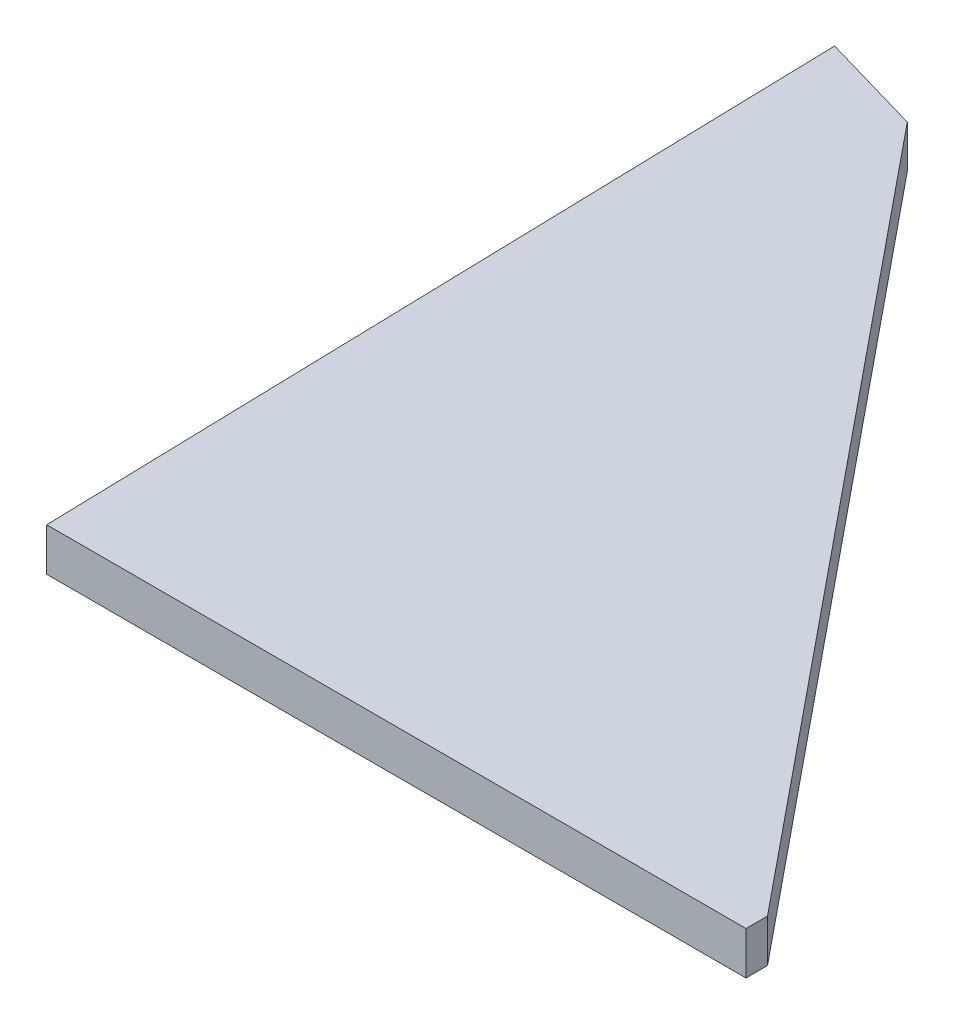
ISO-10303-21;
HEADER;
FILE_DESCRIPTION(('STEP AP214'),'2;1');
FILE_NAME('part.step','',(''),(''),'','','');
FILE_SCHEMA(('AUTOMOTIVE_DESIGN { 1 0 10303 214 1 1 1 1 }'));
ENDSEC;
DATA;
#1=APPLICATION_CONTEXT('core data for automotive mechanical design processes');
#2=APPLICATION_PROTOCOL_DEFINITION('international standard','automotive_design',2000,#1);
#3=PRODUCT_CONTEXT('',#1,'mechanical');
#4=PRODUCT('Part','Part','',(#3));
#5=PRODUCT_RELATED_PRODUCT_CATEGORY('part','',(#4));
#6=PRODUCT_DEFINITION_FORMATION('','',#4);
#7=PRODUCT_DEFINITION_CONTEXT('part definition',#1,'design');
#8=PRODUCT_DEFINITION('design','',#6,#7);
#9=PRODUCT_DEFINITION_SHAPE('','',#8);
#10=(LENGTH_UNIT() NAMED_UNIT(*) SI_UNIT(.MILLI.,.METRE.));
#11=(NAMED_UNIT(*) PLANE_ANGLE_UNIT() SI_UNIT($,.RADIAN.));
#12=(NAMED_UNIT(*) SI_UNIT($,.STERADIAN.) SOLID_ANGLE_UNIT());
#13=UNCERTAINTY_MEASURE_WITH_UNIT(LENGTH_MEASURE(1.E-05),#10,'distance_accuracy_value','');
#14=(GEOMETRIC_REPRESENTATION_CONTEXT(3) GLOBAL_UNCERTAINTY_ASSIGNED_CONTEXT((#13)) GLOBAL_UNIT_ASSIGNED_CONTEXT((#10,
#11,#12)) REPRESENTATION_CONTEXT('',''));
#15=CARTESIAN_POINT('',(0.,0.,0.));
#16=DIRECTION('',(0.,0.,1.));
#17=DIRECTION('',(1.,0.,0.));
#18=AXIS2_PLACEMENT_3D('',#15,#16,#17);
#19=CARTESIAN_POINT('',(32.6229076316677,2.,0.));
#20=DIRECTION('',(-1.,0.,0.));
#21=DIRECTION('',(0.,0.,1.));
#22=AXIS2_PLACEMENT_3D('',#19,#20,#21);
#23=PLANE('',#22);
#24=DIRECTION('',(0.,0.,-1.));
#25=VECTOR('',#24,1.);
#26=CARTESIAN_POINT('',(32.6229076316677,0.,0.));
#27=LINE('',#26,#25);
#28=CARTESIAN_POINT('',(32.6229076316677,0.,0.));
#29=VERTEX_POINT('',#28);
#30=CARTESIAN_POINT('',(32.6229076316677,0.,-1.00441654775911));
#31=VERTEX_POINT('',#30);
#32=EDGE_CURVE('E118',#29,#31,#27,.T.);
#33=ORIENTED_EDGE('',*,*,#32,.T.);
#34=DIRECTION('',(0.,-1.,0.));
#35=VECTOR('',#34,1.);
#36=CARTESIAN_POINT('',(32.6229076316677,2.,-1.00441654775911));
#37=LINE('',#36,#35);
#38=CARTESIAN_POINT('',(32.6229076316677,2.,-1.00441654775911));
#39=VERTEX_POINT('',#38);
#40=EDGE_CURVE('E11',#39,#31,#37,.T.);
#41=ORIENTED_EDGE('',*,*,#40,.F.);
#42=DIRECTION('',(0.,0.,-1.));
#43=VECTOR('',#42,1.);
#44=CARTESIAN_POINT('',(32.6229076316677,2.,0.));
#45=LINE('',#44,#43);
#46=CARTESIAN_POINT('',(32.6229076316677,2.,0.));
#47=VERTEX_POINT('',#46);
#48=EDGE_CURVE('E131',#47,#39,#45,.T.);
#49=ORIENTED_EDGE('',*,*,#48,.F.);
#50=DIRECTION('',(0.,-1.,0.));
#51=VECTOR('',#50,1.);
#52=CARTESIAN_POINT('',(32.6229076316677,2.,0.));
#53=LINE('',#52,#51);
#54=EDGE_CURVE('E114',#47,#29,#53,.T.);
#55=ORIENTED_EDGE('',*,*,#54,.T.);
#56=EDGE_LOOP('',(#33,#41,#49,#55));
#57=FACE_BOUND('',#56,.T.);
#58=ADVANCED_FACE('F39',(#57),#23,.F.);
#59=CARTESIAN_POINT('',(32.6229076316677,2.,-1.00441654775911));
#60=DIRECTION('',(-0.774992731591023,0.,0.631970146431843));
#61=DIRECTION('',(0.631970146431843,0.,0.774992731591023));
#62=AXIS2_PLACEMENT_3D('',#59,#60,#61);
#63=PLANE('',#62);
#64=DIRECTION('',(-0.631970146431843,0.,-0.774992731591023));
#65=VECTOR('',#64,1.);
#66=CARTESIAN_POINT('',(32.6229076316677,0.,-1.00441654775911));
#67=LINE('',#66,#65);
#68=CARTESIAN_POINT('',(3.8052981504117,0.,-36.3438040424033));
#69=VERTEX_POINT('',#68);
#70=EDGE_CURVE('E122',#31,#69,#67,.T.);
#71=ORIENTED_EDGE('',*,*,#70,.T.);
#72=DIRECTION('',(0.,-1.,0.));
#73=VECTOR('',#72,1.);
#74=CARTESIAN_POINT('',(3.8052981504117,2.,-36.3438040424033));
#75=LINE('',#74,#73);
#76=CARTESIAN_POINT('',(3.8052981504117,2.,-36.3438040424033));
#77=VERTEX_POINT('',#76);
#78=EDGE_CURVE('E48',#77,#69,#75,.T.);
#79=ORIENTED_EDGE('',*,*,#78,.F.);
#80=DIRECTION('',(-0.631970146431843,0.,-0.774992731591023));
#81=VECTOR('',#80,1.);
#82=CARTESIAN_POINT('',(32.6229076316677,2.,-1.00441654775911));
#83=LINE('',#82,#81);
#84=EDGE_CURVE('E90',#39,#77,#83,.T.);
#85=ORIENTED_EDGE('',*,*,#84,.F.);
#86=ORIENTED_EDGE('',*,*,#40,.T.);
#87=EDGE_LOOP('',(#71,#79,#85,#86));
#88=FACE_BOUND('',#87,.T.);
#89=ADVANCED_FACE('F153',(#88),#63,.F.);
#90=CARTESIAN_POINT('',(3.8052981504117,2.,-36.3438040424033));
#91=DIRECTION('',(-0.277979583154811,0.,0.96058698270853));
#92=DIRECTION('',(0.96058698270853,0.,0.277979583154811));
#93=AXIS2_PLACEMENT_3D('',#90,#91,#92);
#94=PLANE('',#93);
#95=DIRECTION('',(-0.96058698270853,0.,-0.277979583154811));
#96=VECTOR('',#95,1.);
#97=CARTESIAN_POINT('',(3.8052981504117,0.,-36.3438040424033));
#98=LINE('',#97,#96);
#99=CARTESIAN_POINT('',(-0.96563018671883,0.,-37.7244397310918));
#100=VERTEX_POINT('',#99);
#101=EDGE_CURVE('E106',#69,#100,#98,.T.);
#102=ORIENTED_EDGE('',*,*,#101,.T.);
#103=DIRECTION('',(0.,-1.,0.));
#104=VECTOR('',#103,1.);
#105=CARTESIAN_POINT('',(-0.96563018671883,2.,-37.7244397310918));
#106=LINE('',#105,#104);
#107=CARTESIAN_POINT('',(-0.96563018671883,2.,-37.7244397310918));
#108=VERTEX_POINT('',#107);
#109=EDGE_CURVE('E103',#108,#100,#106,.T.);
#110=ORIENTED_EDGE('',*,*,#109,.F.);
#111=DIRECTION('',(-0.96058698270853,0.,-0.277979583154811));
#112=VECTOR('',#111,1.);
#113=CARTESIAN_POINT('',(3.8052981504117,2.,-36.3438040424033));
#114=LINE('',#113,#112);
#115=EDGE_CURVE('E94',#77,#108,#114,.T.);
#116=ORIENTED_EDGE('',*,*,#115,.F.);
#117=ORIENTED_EDGE('',*,*,#78,.T.);
#118=EDGE_LOOP('',(#102,#110,#116,#117));
#119=FACE_BOUND('',#118,.T.);
#120=ADVANCED_FACE('F104',(#119),#94,.F.);
#121=CARTESIAN_POINT('',(-0.96563018671883,2.,-37.7244397310918));
#122=DIRECTION('',(0.999672559250535,0.,-0.0255885576280988));
#123=DIRECTION('',(-0.0255885576280988,0.,-0.999672559250535));
#124=AXIS2_PLACEMENT_3D('',#121,#122,#123);
#125=PLANE('',#124);
#126=DIRECTION('',(0.0255885576280988,0.,0.999672559250535));
#127=VECTOR('',#126,1.);
#128=CARTESIAN_POINT('',(-0.96563018671883,0.,-37.7244397310918));
#129=LINE('',#128,#127);
#130=CARTESIAN_POINT('',(0.,0.,0.));
#131=VERTEX_POINT('',#130);
#132=EDGE_CURVE('E76',#100,#131,#129,.T.);
#133=ORIENTED_EDGE('',*,*,#132,.T.);
#134=DIRECTION('',(0.,-1.,0.));
#135=VECTOR('',#134,1.);
#136=CARTESIAN_POINT('',(0.,2.,0.));
#137=LINE('',#136,#135);
#138=CARTESIAN_POINT('',(0.,2.,0.));
#139=VERTEX_POINT('',#138);
#140=EDGE_CURVE('E108',#139,#131,#137,.T.);
#141=ORIENTED_EDGE('',*,*,#140,.F.);
#142=DIRECTION('',(0.0255885576280988,0.,0.999672559250535));
#143=VECTOR('',#142,1.);
#144=CARTESIAN_POINT('',(-0.96563018671883,2.,-37.7244397310918));
#145=LINE('',#144,#143);
#146=EDGE_CURVE('E98',#108,#139,#145,.T.);
#147=ORIENTED_EDGE('',*,*,#146,.F.);
#148=ORIENTED_EDGE('',*,*,#109,.T.);
#149=EDGE_LOOP('',(#133,#141,#147,#148));
#150=FACE_BOUND('',#149,.T.);
#151=ADVANCED_FACE('F110',(#150),#125,.F.);
#152=CARTESIAN_POINT('',(0.,2.,0.));
#153=DIRECTION('',(0.,0.,-1.));
#154=DIRECTION('',(-1.,0.,0.));
#155=AXIS2_PLACEMENT_3D('',#152,#153,#154);
#156=PLANE('',#155);
#157=DIRECTION('',(1.,0.,0.));
#158=VECTOR('',#157,1.);
#159=CARTESIAN_POINT('',(0.,0.,0.));
#160=LINE('',#159,#158);
#161=EDGE_CURVE('E82',#131,#29,#160,.T.);
#162=ORIENTED_EDGE('',*,*,#161,.T.);
#163=ORIENTED_EDGE('',*,*,#54,.F.);
#164=DIRECTION('',(1.,0.,0.));
#165=VECTOR('',#164,1.);
#166=CARTESIAN_POINT('',(0.,2.,0.));
#167=LINE('',#166,#165);
#168=EDGE_CURVE('E56',#139,#47,#167,.T.);
#169=ORIENTED_EDGE('',*,*,#168,.F.);
#170=ORIENTED_EDGE('',*,*,#140,.T.);
#171=EDGE_LOOP('',(#162,#163,#169,#170));
#172=FACE_BOUND('',#171,.T.);
#173=ADVANCED_FACE('F142',(#172),#156,.F.);
#174=CARTESIAN_POINT('',(0.,2.,0.));
#175=DIRECTION('',(0.,-1.,0.));
#176=DIRECTION('',(0.,0.,-1.));
#177=AXIS2_PLACEMENT_3D('',#174,#175,#176);
#178=PLANE('',#177);
#179=ORIENTED_EDGE('',*,*,#48,.T.);
#180=ORIENTED_EDGE('',*,*,#84,.T.);
#181=ORIENTED_EDGE('',*,*,#115,.T.);
#182=ORIENTED_EDGE('',*,*,#146,.T.);
#183=ORIENTED_EDGE('',*,*,#168,.T.);
#184=EDGE_LOOP('',(#179,#180,#181,#182,#183));
#185=FACE_BOUND('',#184,.T.);
#186=ADVANCED_FACE('F96',(#185),#178,.F.);
#187=CARTESIAN_POINT('',(0.,0.,0.));
#188=DIRECTION('',(0.,-1.,0.));
#189=DIRECTION('',(0.,0.,-1.));
#190=AXIS2_PLACEMENT_3D('',#187,#188,#189);
#191=PLANE('',#190);
#192=ORIENTED_EDGE('',*,*,#32,.F.);
#193=ORIENTED_EDGE('',*,*,#161,.F.);
#194=ORIENTED_EDGE('',*,*,#132,.F.);
#195=ORIENTED_EDGE('',*,*,#101,.F.);
#196=ORIENTED_EDGE('',*,*,#70,.F.);
#197=EDGE_LOOP('',(#192,#193,#194,#195,#196));
#198=FACE_BOUND('',#197,.T.);
#199=ADVANCED_FACE('F138',(#198),#191,.T.);
#200=CLOSED_SHELL('',(#58,#89,#120,#151,#173,#186,#199));
#201=MANIFOLD_SOLID_BREP('B2',#200);
#202=ADVANCED_BREP_SHAPE_REPRESENTATION('',(#18,#201),#14);
#203=SHAPE_DEFINITION_REPRESENTATION(#9,#202);
ENDSEC;
END-ISO-10303-21;
